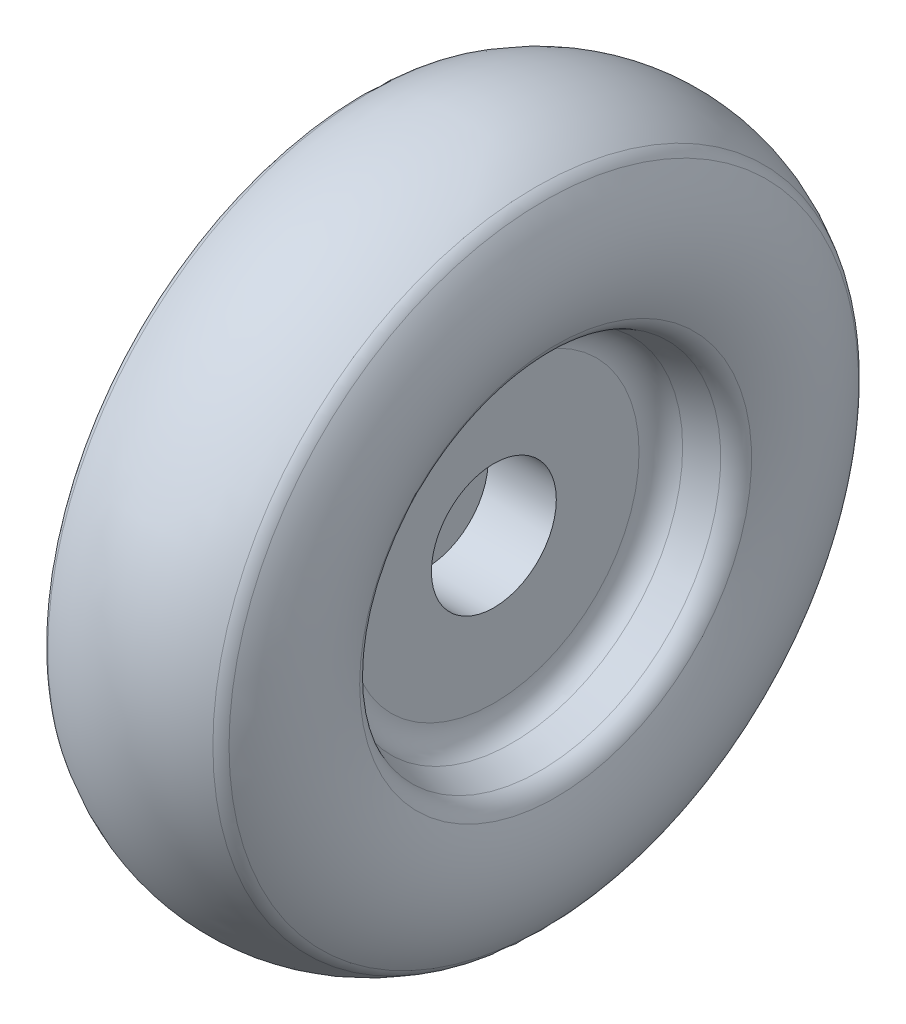
ISO-10303-21;
HEADER;
FILE_DESCRIPTION(('STEP AP214'),'2;1');
FILE_NAME('part.step','',(''),(''),'','','');
FILE_SCHEMA(('AUTOMOTIVE_DESIGN { 1 0 10303 214 1 1 1 1 }'));
ENDSEC;
DATA;
#1=APPLICATION_CONTEXT('core data for automotive mechanical design processes');
#2=APPLICATION_PROTOCOL_DEFINITION('international standard','automotive_design',2000,#1);
#3=PRODUCT_CONTEXT('',#1,'mechanical');
#4=PRODUCT('Part','Part','',(#3));
#5=PRODUCT_RELATED_PRODUCT_CATEGORY('part','',(#4));
#6=PRODUCT_DEFINITION_FORMATION('','',#4);
#7=PRODUCT_DEFINITION_CONTEXT('part definition',#1,'design');
#8=PRODUCT_DEFINITION('design','',#6,#7);
#9=PRODUCT_DEFINITION_SHAPE('','',#8);
#10=(LENGTH_UNIT() NAMED_UNIT(*) SI_UNIT(.MILLI.,.METRE.));
#11=(NAMED_UNIT(*) PLANE_ANGLE_UNIT() SI_UNIT($,.RADIAN.));
#12=(NAMED_UNIT(*) SI_UNIT($,.STERADIAN.) SOLID_ANGLE_UNIT());
#13=UNCERTAINTY_MEASURE_WITH_UNIT(LENGTH_MEASURE(1.E-05),#10,'distance_accuracy_value','');
#14=(GEOMETRIC_REPRESENTATION_CONTEXT(3) GLOBAL_UNCERTAINTY_ASSIGNED_CONTEXT((#13)) GLOBAL_UNIT_ASSIGNED_CONTEXT((#10,
#11,#12)) REPRESENTATION_CONTEXT('',''));
#15=CARTESIAN_POINT('',(0.,0.,0.));
#16=DIRECTION('',(0.,0.,1.));
#17=DIRECTION('',(1.,0.,0.));
#18=AXIS2_PLACEMENT_3D('',#15,#16,#17);
#19=CARTESIAN_POINT('',(176.414642060749,0.,0.));
#20=DIRECTION('',(-1.,0.,0.));
#21=DIRECTION('',(0.,0.,1.));
#22=AXIS2_PLACEMENT_3D('',#19,#20,#21);
#23=CONICAL_SURFACE('',#22,4.06678152556044,0.347267741666858);
#24=CARTESIAN_POINT('',(176.643479793704,0.,0.));
#25=DIRECTION('',(1.,0.,0.));
#26=DIRECTION('',(0.,0.,-1.));
#27=AXIS2_PLACEMENT_3D('',#24,#25,#26);
#28=CIRCLE('',#27,3.98395708303929);
#29=CARTESIAN_POINT('',(176.643479793704,0.,-3.98395708303929));
#30=VERTEX_POINT('',#29);
#31=EDGE_CURVE('E50',#30,#30,#28,.F.);
#32=ORIENTED_EDGE('',*,*,#31,.T.);
#33=EDGE_LOOP('',(#32));
#34=FACE_BOUND('',#33,.T.);
#35=CARTESIAN_POINT('',(177.259197953092,0.,0.));
#36=DIRECTION('',(-1.,0.,0.));
#37=DIRECTION('',(0.,0.,1.));
#38=AXIS2_PLACEMENT_3D('',#35,#36,#37);
#39=CIRCLE('',#38,3.76110697592198);
#40=CARTESIAN_POINT('',(177.259197953092,0.,3.76110697592197));
#41=VERTEX_POINT('',#40);
#42=EDGE_CURVE('E74',#41,#41,#39,.F.);
#43=ORIENTED_EDGE('',*,*,#42,.T.);
#44=EDGE_LOOP('',(#43));
#45=FACE_BOUND('',#44,.T.);
#46=ADVANCED_FACE('F42',(#34,#45),#23,.F.);
#47=CARTESIAN_POINT('',(178.284648741618,0.,0.));
#48=DIRECTION('',(-1.,0.,0.));
#49=DIRECTION('',(0.,0.,1.));
#50=AXIS2_PLACEMENT_3D('',#47,#48,#49);
#51=TOROIDAL_SURFACE('',#50,5.3834716941737,2.74685125838165);
#52=CARTESIAN_POINT('',(180.554371481048,0.,0.));
#53=DIRECTION('',(-1.,0.,0.));
#54=DIRECTION('',(0.,0.,1.));
#55=AXIS2_PLACEMENT_3D('',#52,#53,#54);
#56=CIRCLE('',#55,6.9305820721977);
#57=CARTESIAN_POINT('',(180.554371481048,0.,6.9305820721977));
#58=VERTEX_POINT('',#57);
#59=EDGE_CURVE('E62',#58,#58,#56,.F.);
#60=ORIENTED_EDGE('',*,*,#59,.T.);
#61=EDGE_LOOP('',(#60));
#62=FACE_BOUND('',#61,.T.);
#63=CARTESIAN_POINT('',(180.815040613322,0.,0.));
#64=DIRECTION('',(-1.,0.,0.));
#65=DIRECTION('',(0.,0.,1.));
#66=AXIS2_PLACEMENT_3D('',#63,#64,#65);
#67=CIRCLE('',#66,4.31468321590119);
#68=CARTESIAN_POINT('',(180.815040613322,0.,4.31468321590119));
#69=VERTEX_POINT('',#68);
#70=EDGE_CURVE('E65',#69,#69,#67,.T.);
#71=ORIENTED_EDGE('',*,*,#70,.T.);
#72=EDGE_LOOP('',(#71));
#73=FACE_BOUND('',#72,.T.);
#74=ADVANCED_FACE('F134',(#62,#73),#51,.T.);
#75=CARTESIAN_POINT('',(178.555,0.,0.));
#76=DIRECTION('',(-1.,0.,0.));
#77=DIRECTION('',(0.,0.,1.));
#78=AXIS2_PLACEMENT_3D('',#75,#76,#77);
#79=TOROIDAL_SURFACE('',#78,4.14061448859882,3.47632322251781);
#80=CARTESIAN_POINT('',(180.372240248804,0.,0.));
#81=DIRECTION('',(-1.,0.,0.));
#82=DIRECTION('',(0.,0.,1.));
#83=AXIS2_PLACEMENT_3D('',#80,#81,#82);
#84=CIRCLE('',#83,7.10413621545429);
#85=CARTESIAN_POINT('',(180.372240248804,0.,7.10413621545429));
#86=VERTEX_POINT('',#85);
#87=EDGE_CURVE('E68',#86,#86,#84,.T.);
#88=ORIENTED_EDGE('',*,*,#87,.T.);
#89=EDGE_LOOP('',(#88));
#90=FACE_BOUND('',#89,.T.);
#91=CARTESIAN_POINT('',(176.737759751196,0.,0.));
#92=DIRECTION('',(1.,0.,0.));
#93=DIRECTION('',(0.,0.,-1.));
#94=AXIS2_PLACEMENT_3D('',#91,#92,#93);
#95=CIRCLE('',#94,7.10413621545429);
#96=CARTESIAN_POINT('',(176.737759751196,0.,-7.10413621545429));
#97=VERTEX_POINT('',#96);
#98=EDGE_CURVE('E71',#97,#97,#95,.T.);
#99=ORIENTED_EDGE('',*,*,#98,.T.);
#100=EDGE_LOOP('',(#99));
#101=FACE_BOUND('',#100,.T.);
#102=ADVANCED_FACE('F140',(#90,#101),#79,.T.);
#103=CARTESIAN_POINT('',(178.825351258382,0.,0.));
#104=DIRECTION('',(-1.,0.,0.));
#105=DIRECTION('',(0.,0.,1.));
#106=AXIS2_PLACEMENT_3D('',#103,#104,#105);
#107=TOROIDAL_SURFACE('',#106,5.3834716941737,2.74685125838165);
#108=CARTESIAN_POINT('',(176.555628518952,0.,0.));
#109=DIRECTION('',(1.,0.,0.));
#110=DIRECTION('',(0.,0.,-1.));
#111=AXIS2_PLACEMENT_3D('',#108,#109,#110);
#112=CIRCLE('',#111,6.93058207219771);
#113=CARTESIAN_POINT('',(176.555628518952,0.,-6.93058207219771));
#114=VERTEX_POINT('',#113);
#115=EDGE_CURVE('E54',#114,#114,#112,.F.);
#116=ORIENTED_EDGE('',*,*,#115,.T.);
#117=EDGE_LOOP('',(#116));
#118=FACE_BOUND('',#117,.T.);
#119=CARTESIAN_POINT('',(176.294959386678,0.,0.));
#120=DIRECTION('',(1.,0.,0.));
#121=DIRECTION('',(0.,0.,-1.));
#122=AXIS2_PLACEMENT_3D('',#119,#120,#121);
#123=CIRCLE('',#122,4.31468321590119);
#124=CARTESIAN_POINT('',(176.294959386678,0.,-4.31468321590119));
#125=VERTEX_POINT('',#124);
#126=EDGE_CURVE('E59',#125,#125,#123,.T.);
#127=ORIENTED_EDGE('',*,*,#126,.T.);
#128=EDGE_LOOP('',(#127));
#129=FACE_BOUND('',#128,.T.);
#130=ADVANCED_FACE('F147',(#118,#129),#107,.T.);
#131=CARTESIAN_POINT('',(178.555,0.,0.));
#132=DIRECTION('',(1.,0.,0.));
#133=DIRECTION('',(0.,0.,-1.));
#134=AXIS2_PLACEMENT_3D('',#131,#132,#133);
#135=CONICAL_SURFACE('',#134,3.29211053566254,0.347267741666859);
#136=CARTESIAN_POINT('',(180.466520206296,0.,0.));
#137=DIRECTION('',(-1.,0.,0.));
#138=DIRECTION('',(0.,0.,1.));
#139=AXIS2_PLACEMENT_3D('',#136,#137,#138);
#140=CIRCLE('',#139,3.98395708303929);
#141=CARTESIAN_POINT('',(180.466520206296,0.,3.98395708303929));
#142=VERTEX_POINT('',#141);
#143=EDGE_CURVE('E10',#142,#142,#140,.F.);
#144=ORIENTED_EDGE('',*,*,#143,.T.);
#145=EDGE_LOOP('',(#144));
#146=FACE_BOUND('',#145,.T.);
#147=CARTESIAN_POINT('',(179.850802046908,0.,0.));
#148=DIRECTION('',(-1.,0.,0.));
#149=DIRECTION('',(0.,0.,1.));
#150=AXIS2_PLACEMENT_3D('',#147,#148,#149);
#151=CIRCLE('',#150,3.76110697592198);
#152=CARTESIAN_POINT('',(179.850802046908,0.,3.76110697592197));
#153=VERTEX_POINT('',#152);
#154=EDGE_CURVE('E83',#153,#153,#151,.T.);
#155=ORIENTED_EDGE('',*,*,#154,.T.);
#156=EDGE_LOOP('',(#155));
#157=FACE_BOUND('',#156,.T.);
#158=ADVANCED_FACE('F146',(#146,#157),#135,.F.);
#159=CARTESIAN_POINT('',(179.455,0.,0.));
#160=DIRECTION('',(1.,0.,0.));
#161=DIRECTION('',(0.,0.,-1.));
#162=AXIS2_PLACEMENT_3D('',#159,#160,#161);
#163=PLANE('',#162);
#164=CARTESIAN_POINT('',(179.455,0.,0.));
#165=DIRECTION('',(1.,0.,0.));
#166=DIRECTION('',(0.,0.,-1.));
#167=AXIS2_PLACEMENT_3D('',#164,#165,#166);
#168=CIRCLE('',#167,1.375);
#169=CARTESIAN_POINT('',(179.455,0.,-1.375));
#170=VERTEX_POINT('',#169);
#171=EDGE_CURVE('E46',#170,#170,#168,.T.);
#172=ORIENTED_EDGE('',*,*,#171,.F.);
#173=EDGE_LOOP('',(#172));
#174=FACE_BOUND('',#173,.T.);
#175=CARTESIAN_POINT('',(179.455,0.,0.));
#176=DIRECTION('',(1.,0.,0.));
#177=DIRECTION('',(0.,0.,-1.));
#178=AXIS2_PLACEMENT_3D('',#175,#176,#177);
#179=CIRCLE('',#178,3.19692332146813);
#180=CARTESIAN_POINT('',(179.455,0.,-3.19692332146813));
#181=VERTEX_POINT('',#180);
#182=EDGE_CURVE('E80',#181,#181,#179,.T.);
#183=ORIENTED_EDGE('',*,*,#182,.T.);
#184=EDGE_LOOP('',(#183));
#185=FACE_BOUND('',#184,.T.);
#186=ADVANCED_FACE('F114',(#174,#185),#163,.T.);
#187=CARTESIAN_POINT('',(177.655,0.,0.));
#188=DIRECTION('',(1.,0.,0.));
#189=DIRECTION('',(0.,0.,-1.));
#190=AXIS2_PLACEMENT_3D('',#187,#188,#189);
#191=PLANE('',#190);
#192=CARTESIAN_POINT('',(177.655,0.,0.));
#193=DIRECTION('',(-1.,0.,0.));
#194=DIRECTION('',(0.,0.,1.));
#195=AXIS2_PLACEMENT_3D('',#192,#193,#194);
#196=CIRCLE('',#195,0.65);
#197=CARTESIAN_POINT('',(177.655,0.,0.65));
#198=VERTEX_POINT('',#197);
#199=EDGE_CURVE('E86',#198,#198,#196,.T.);
#200=ORIENTED_EDGE('',*,*,#199,.F.);
#201=EDGE_LOOP('',(#200));
#202=FACE_BOUND('',#201,.T.);
#203=CARTESIAN_POINT('',(177.655,0.,0.));
#204=DIRECTION('',(1.,0.,0.));
#205=DIRECTION('',(0.,0.,-1.));
#206=AXIS2_PLACEMENT_3D('',#203,#204,#205);
#207=CIRCLE('',#206,3.19692332146813);
#208=CARTESIAN_POINT('',(177.655,0.,-3.19692332146813));
#209=VERTEX_POINT('',#208);
#210=EDGE_CURVE('E77',#209,#209,#207,.F.);
#211=ORIENTED_EDGE('',*,*,#210,.T.);
#212=EDGE_LOOP('',(#211));
#213=FACE_BOUND('',#212,.T.);
#214=ADVANCED_FACE('F110',(#202,#213),#191,.F.);
#215=CARTESIAN_POINT('',(180.055,0.,0.));
#216=DIRECTION('',(1.,0.,0.));
#217=DIRECTION('',(0.,0.,-1.));
#218=AXIS2_PLACEMENT_3D('',#215,#216,#217);
#219=TOROIDAL_SURFACE('',#218,3.19692332146813,0.6);
#220=ORIENTED_EDGE('',*,*,#182,.F.);
#221=EDGE_LOOP('',(#220));
#222=FACE_BOUND('',#221,.T.);
#223=ORIENTED_EDGE('',*,*,#154,.F.);
#224=EDGE_LOOP('',(#223));
#225=FACE_BOUND('',#224,.T.);
#226=ADVANCED_FACE('F113',(#222,#225),#219,.F.);
#227=CARTESIAN_POINT('',(177.055,0.,0.));
#228=DIRECTION('',(1.,0.,0.));
#229=DIRECTION('',(0.,0.,-1.));
#230=AXIS2_PLACEMENT_3D('',#227,#228,#229);
#231=TOROIDAL_SURFACE('',#230,3.19692332146813,0.6);
#232=ORIENTED_EDGE('',*,*,#42,.F.);
#233=EDGE_LOOP('',(#232));
#234=FACE_BOUND('',#233,.T.);
#235=ORIENTED_EDGE('',*,*,#210,.F.);
#236=EDGE_LOOP('',(#235));
#237=FACE_BOUND('',#236,.T.);
#238=ADVANCED_FACE('F118',(#234,#237),#231,.F.);
#239=CARTESIAN_POINT('',(180.058591580515,0.,0.));
#240=DIRECTION('',(1.,0.,0.));
#241=DIRECTION('',(0.,0.,-1.));
#242=AXIS2_PLACEMENT_3D('',#239,#240,#241);
#243=TOROIDAL_SURFACE('',#242,6.59264377867638,0.6);
#244=ORIENTED_EDGE('',*,*,#59,.F.);
#245=EDGE_LOOP('',(#244));
#246=FACE_BOUND('',#245,.T.);
#247=ORIENTED_EDGE('',*,*,#87,.F.);
#248=EDGE_LOOP('',(#247));
#249=FACE_BOUND('',#248,.T.);
#250=ADVANCED_FACE('F120',(#246,#249),#243,.T.);
#251=CARTESIAN_POINT('',(177.051408419485,0.,0.));
#252=DIRECTION('',(1.,0.,0.));
#253=DIRECTION('',(0.,0.,-1.));
#254=AXIS2_PLACEMENT_3D('',#251,#252,#253);
#255=TOROIDAL_SURFACE('',#254,6.59264377867638,0.6);
#256=ORIENTED_EDGE('',*,*,#98,.F.);
#257=EDGE_LOOP('',(#256));
#258=FACE_BOUND('',#257,.T.);
#259=ORIENTED_EDGE('',*,*,#115,.F.);
#260=EDGE_LOOP('',(#259));
#261=FACE_BOUND('',#260,.T.);
#262=ADVANCED_FACE('F127',(#258,#261),#255,.T.);
#263=CARTESIAN_POINT('',(176.847677746796,0.,0.));
#264=DIRECTION('',(1.,0.,0.));
#265=DIRECTION('',(0.,0.,-1.));
#266=AXIS2_PLACEMENT_3D('',#263,#264,#265);
#267=TOROIDAL_SURFACE('',#266,4.54814073749314,0.6);
#268=ORIENTED_EDGE('',*,*,#126,.F.);
#269=EDGE_LOOP('',(#268));
#270=FACE_BOUND('',#269,.T.);
#271=ORIENTED_EDGE('',*,*,#31,.F.);
#272=EDGE_LOOP('',(#271));
#273=FACE_BOUND('',#272,.T.);
#274=ADVANCED_FACE('F161',(#270,#273),#267,.T.);
#275=CARTESIAN_POINT('',(180.262322253204,0.,0.));
#276=DIRECTION('',(1.,0.,0.));
#277=DIRECTION('',(0.,0.,-1.));
#278=AXIS2_PLACEMENT_3D('',#275,#276,#277);
#279=TOROIDAL_SURFACE('',#278,4.54814073749314,0.6);
#280=ORIENTED_EDGE('',*,*,#143,.F.);
#281=EDGE_LOOP('',(#280));
#282=FACE_BOUND('',#281,.T.);
#283=ORIENTED_EDGE('',*,*,#70,.F.);
#284=EDGE_LOOP('',(#283));
#285=FACE_BOUND('',#284,.T.);
#286=ADVANCED_FACE('F44',(#282,#285),#279,.T.);
#287=CARTESIAN_POINT('',(177.955,0.,0.));
#288=DIRECTION('',(-1.,0.,0.));
#289=DIRECTION('',(0.,0.,1.));
#290=AXIS2_PLACEMENT_3D('',#287,#288,#289);
#291=CYLINDRICAL_SURFACE('',#290,0.65);
#292=CARTESIAN_POINT('',(177.955,0.,0.));
#293=DIRECTION('',(-1.,0.,0.));
#294=DIRECTION('',(0.,0.,1.));
#295=AXIS2_PLACEMENT_3D('',#292,#293,#294);
#296=CIRCLE('',#295,0.65);
#297=CARTESIAN_POINT('',(177.955,0.,0.65));
#298=VERTEX_POINT('',#297);
#299=EDGE_CURVE('E89',#298,#298,#296,.F.);
#300=ORIENTED_EDGE('',*,*,#299,.T.);
#301=EDGE_LOOP('',(#300));
#302=FACE_BOUND('',#301,.T.);
#303=ORIENTED_EDGE('',*,*,#199,.T.);
#304=EDGE_LOOP('',(#303));
#305=FACE_BOUND('',#304,.T.);
#306=ADVANCED_FACE('F101',(#302,#305),#291,.F.);
#307=CARTESIAN_POINT('',(177.955,0.,0.));
#308=DIRECTION('',(-1.,0.,0.));
#309=DIRECTION('',(0.,0.,1.));
#310=AXIS2_PLACEMENT_3D('',#307,#308,#309);
#311=PLANE('',#310);
#312=CARTESIAN_POINT('',(177.955,0.,0.));
#313=DIRECTION('',(-1.,0.,0.));
#314=DIRECTION('',(0.,0.,1.));
#315=AXIS2_PLACEMENT_3D('',#312,#313,#314);
#316=CIRCLE('',#315,1.375);
#317=CARTESIAN_POINT('',(177.955,0.,1.375));
#318=VERTEX_POINT('',#317);
#319=EDGE_CURVE('E92',#318,#318,#316,.T.);
#320=ORIENTED_EDGE('',*,*,#319,.F.);
#321=EDGE_LOOP('',(#320));
#322=FACE_BOUND('',#321,.T.);
#323=ORIENTED_EDGE('',*,*,#299,.F.);
#324=EDGE_LOOP('',(#323));
#325=FACE_BOUND('',#324,.T.);
#326=ADVANCED_FACE('F98',(#322,#325),#311,.F.);
#327=CARTESIAN_POINT('',(181.0315,0.,0.));
#328=DIRECTION('',(-1.,0.,0.));
#329=DIRECTION('',(0.,0.,1.));
#330=AXIS2_PLACEMENT_3D('',#327,#328,#329);
#331=CYLINDRICAL_SURFACE('',#330,1.375);
#332=ORIENTED_EDGE('',*,*,#171,.T.);
#333=EDGE_LOOP('',(#332));
#334=FACE_BOUND('',#333,.T.);
#335=ORIENTED_EDGE('',*,*,#319,.T.);
#336=EDGE_LOOP('',(#335));
#337=FACE_BOUND('',#336,.T.);
#338=ADVANCED_FACE('F96',(#334,#337),#331,.F.);
#339=CLOSED_SHELL('',(#46,#74,#102,#130,#158,#186,#214,#226,#238,#250,#262,#274,#286,#306,#326,#338));
#340=MANIFOLD_SOLID_BREP('B2',#339);
#341=ADVANCED_BREP_SHAPE_REPRESENTATION('',(#18,#340),#14);
#342=SHAPE_DEFINITION_REPRESENTATION(#9,#341);
ENDSEC;
END-ISO-10303-21;
